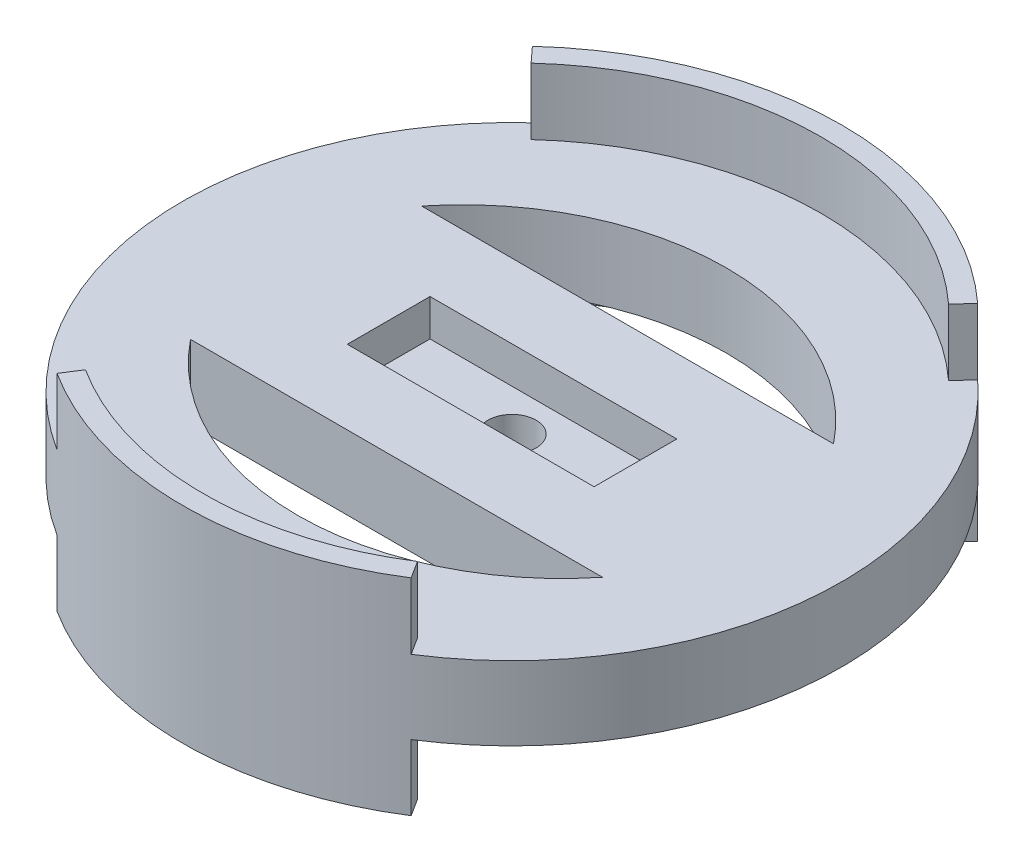
ISO-10303-21;
HEADER;
FILE_DESCRIPTION(('STEP AP214'),'2;1');
FILE_NAME('part.step','',(''),(''),'','','');
FILE_SCHEMA(('AUTOMOTIVE_DESIGN { 1 0 10303 214 1 1 1 1 }'));
ENDSEC;
DATA;
#1=APPLICATION_CONTEXT('core data for automotive mechanical design processes');
#2=APPLICATION_PROTOCOL_DEFINITION('international standard','automotive_design',2000,#1);
#3=PRODUCT_CONTEXT('',#1,'mechanical');
#4=PRODUCT('Part','Part','',(#3));
#5=PRODUCT_RELATED_PRODUCT_CATEGORY('part','',(#4));
#6=PRODUCT_DEFINITION_FORMATION('','',#4);
#7=PRODUCT_DEFINITION_CONTEXT('part definition',#1,'design');
#8=PRODUCT_DEFINITION('design','',#6,#7);
#9=PRODUCT_DEFINITION_SHAPE('','',#8);
#10=(LENGTH_UNIT() NAMED_UNIT(*) SI_UNIT(.MILLI.,.METRE.));
#11=(NAMED_UNIT(*) PLANE_ANGLE_UNIT() SI_UNIT($,.RADIAN.));
#12=(NAMED_UNIT(*) SI_UNIT($,.STERADIAN.) SOLID_ANGLE_UNIT());
#13=UNCERTAINTY_MEASURE_WITH_UNIT(LENGTH_MEASURE(1.E-05),#10,'distance_accuracy_value','');
#14=(GEOMETRIC_REPRESENTATION_CONTEXT(3) GLOBAL_UNCERTAINTY_ASSIGNED_CONTEXT((#13)) GLOBAL_UNIT_ASSIGNED_CONTEXT((#10,
#11,#12)) REPRESENTATION_CONTEXT('',''));
#15=CARTESIAN_POINT('',(0.,0.,0.));
#16=DIRECTION('',(0.,0.,1.));
#17=DIRECTION('',(1.,0.,0.));
#18=AXIS2_PLACEMENT_3D('',#15,#16,#17);
#19=CARTESIAN_POINT('',(0.,5.6642,0.));
#20=DIRECTION('',(0.,1.,0.));
#21=DIRECTION('',(0.,0.,1.));
#22=AXIS2_PLACEMENT_3D('',#19,#20,#21);
#23=PLANE('',#22);
#24=CARTESIAN_POINT('',(0.,5.6642,7.64751666666668));
#25=DIRECTION('',(0.,1.,0.));
#26=DIRECTION('',(0.,0.,-1.));
#27=AXIS2_PLACEMENT_3D('',#24,#25,#26);
#28=CIRCLE('',#27,40.6929166666667);
#29=CARTESIAN_POINT('',(31.75,5.6642,-17.8054));
#30=VERTEX_POINT('',#29);
#31=CARTESIAN_POINT('',(-31.75,5.6642,-17.8054));
#32=VERTEX_POINT('',#31);
#33=EDGE_CURVE('E57',#30,#32,#28,.T.);
#34=ORIENTED_EDGE('',*,*,#33,.F.);
#35=DIRECTION('',(1.,0.,0.));
#36=VECTOR('',#35,1.);
#37=CARTESIAN_POINT('',(-31.75,5.6642,-17.8054));
#38=LINE('',#37,#36);
#39=EDGE_CURVE('E213',#32,#30,#38,.T.);
#40=ORIENTED_EDGE('',*,*,#39,.F.);
#41=EDGE_LOOP('',(#34,#40));
#42=FACE_BOUND('',#41,.T.);
#43=CARTESIAN_POINT('',(0.,5.6642,-7.64751666666668));
#44=DIRECTION('',(0.,1.,0.));
#45=DIRECTION('',(0.,0.,1.));
#46=AXIS2_PLACEMENT_3D('',#43,#44,#45);
#47=CIRCLE('',#46,40.6929166666667);
#48=CARTESIAN_POINT('',(-31.75,5.6642,17.8054));
#49=VERTEX_POINT('',#48);
#50=CARTESIAN_POINT('',(31.75,5.6642,17.8054));
#51=VERTEX_POINT('',#50);
#52=EDGE_CURVE('E65',#49,#51,#47,.T.);
#53=ORIENTED_EDGE('',*,*,#52,.F.);
#54=DIRECTION('',(-1.,0.,0.));
#55=VECTOR('',#54,1.);
#56=CARTESIAN_POINT('',(-31.75,5.6642,17.8054));
#57=LINE('',#56,#55);
#58=EDGE_CURVE('E230',#51,#49,#57,.T.);
#59=ORIENTED_EDGE('',*,*,#58,.F.);
#60=EDGE_LOOP('',(#53,#59));
#61=FACE_BOUND('',#60,.T.);
#62=DIRECTION('',(-1.,0.,0.));
#63=VECTOR('',#62,1.);
#64=CARTESIAN_POINT('',(0.,5.6642,6.3754));
#65=LINE('',#64,#63);
#66=CARTESIAN_POINT('',(19.01825,5.6642,6.3754));
#67=VERTEX_POINT('',#66);
#68=CARTESIAN_POINT('',(-19.01825,5.6642,6.3754));
#69=VERTEX_POINT('',#68);
#70=EDGE_CURVE('E376',#67,#69,#65,.T.);
#71=ORIENTED_EDGE('',*,*,#70,.T.);
#72=DIRECTION('',(0.,0.,-1.));
#73=VECTOR('',#72,1.);
#74=CARTESIAN_POINT('',(-19.01825,5.6642,0.));
#75=LINE('',#74,#73);
#76=CARTESIAN_POINT('',(-19.01825,5.6642,-6.3754));
#77=VERTEX_POINT('',#76);
#78=EDGE_CURVE('E380',#69,#77,#75,.T.);
#79=ORIENTED_EDGE('',*,*,#78,.T.);
#80=DIRECTION('',(-1.,0.,0.));
#81=VECTOR('',#80,1.);
#82=CARTESIAN_POINT('',(0.,5.6642,-6.3754));
#83=LINE('',#82,#81);
#84=CARTESIAN_POINT('',(19.01825,5.6642,-6.3754));
#85=VERTEX_POINT('',#84);
#86=EDGE_CURVE('E384',#85,#77,#83,.T.);
#87=ORIENTED_EDGE('',*,*,#86,.F.);
#88=DIRECTION('',(0.,0.,-1.));
#89=VECTOR('',#88,1.);
#90=CARTESIAN_POINT('',(19.01825,5.6642,0.));
#91=LINE('',#90,#89);
#92=EDGE_CURVE('E388',#67,#85,#91,.T.);
#93=ORIENTED_EDGE('',*,*,#92,.F.);
#94=EDGE_LOOP('',(#71,#79,#87,#93));
#95=FACE_BOUND('',#94,.T.);
#96=CARTESIAN_POINT('',(0.,5.6642,0.));
#97=DIRECTION('',(0.,1.,0.));
#98=DIRECTION('',(0.,0.,1.));
#99=AXIS2_PLACEMENT_3D('',#96,#97,#98);
#100=CIRCLE('',#99,47.625);
#101=CARTESIAN_POINT('',(-25.5888938475175,5.6642,40.1665176068387));
#102=VERTEX_POINT('',#101);
#103=CARTESIAN_POINT('',(25.5888938475175,5.6642,40.1665176068387));
#104=VERTEX_POINT('',#103);
#105=EDGE_CURVE('E298',#102,#104,#100,.T.);
#106=ORIENTED_EDGE('',*,*,#105,.T.);
#107=DIRECTION('',(0.537299608346824,0.,0.843391445812885));
#108=VECTOR('',#107,1.);
#109=CARTESIAN_POINT('',(0.,5.6642,0.));
#110=LINE('',#109,#108);
#111=CARTESIAN_POINT('',(27.2948201040187,5.6642,42.8442854472946));
#112=VERTEX_POINT('',#111);
#113=EDGE_CURVE('E294',#104,#112,#110,.T.);
#114=ORIENTED_EDGE('',*,*,#113,.T.);
#115=CARTESIAN_POINT('',(0.,5.6642,0.));
#116=DIRECTION('',(0.,1.,0.));
#117=DIRECTION('',(0.,0.,1.));
#118=AXIS2_PLACEMENT_3D('',#115,#116,#117);
#119=CIRCLE('',#118,50.8);
#120=CARTESIAN_POINT('',(34.3199825468756,5.6642,-37.4536887099543));
#121=VERTEX_POINT('',#120);
#122=EDGE_CURVE('E392',#112,#121,#119,.T.);
#123=ORIENTED_EDGE('',*,*,#122,.T.);
#124=DIRECTION('',(-0.675590207615662,0.,0.737277336810123));
#125=VECTOR('',#124,1.);
#126=CARTESIAN_POINT('',(0.,5.6642,0.));
#127=LINE('',#126,#125);
#128=CARTESIAN_POINT('',(32.1749836376959,5.6642,-35.1128331655821));
#129=VERTEX_POINT('',#128);
#130=EDGE_CURVE('E354',#121,#129,#127,.T.);
#131=ORIENTED_EDGE('',*,*,#130,.T.);
#132=CARTESIAN_POINT('',(0.,5.6642,0.));
#133=DIRECTION('',(0.,1.,0.));
#134=DIRECTION('',(0.,0.,1.));
#135=AXIS2_PLACEMENT_3D('',#132,#133,#134);
#136=CIRCLE('',#135,47.625);
#137=CARTESIAN_POINT('',(-32.1749836376959,5.6642,-35.1128331655821));
#138=VERTEX_POINT('',#137);
#139=EDGE_CURVE('E358',#129,#138,#136,.T.);
#140=ORIENTED_EDGE('',*,*,#139,.T.);
#141=DIRECTION('',(-0.675590207615662,0.,-0.737277336810123));
#142=VECTOR('',#141,1.);
#143=CARTESIAN_POINT('',(0.,5.6642,0.));
#144=LINE('',#143,#142);
#145=CARTESIAN_POINT('',(-34.3199825468756,5.6642,-37.4536887099542));
#146=VERTEX_POINT('',#145);
#147=EDGE_CURVE('E350',#138,#146,#144,.T.);
#148=ORIENTED_EDGE('',*,*,#147,.T.);
#149=CARTESIAN_POINT('',(-27.2948201040187,5.6642,42.8442854472946));
#150=VERTEX_POINT('',#149);
#151=EDGE_CURVE('E393',#146,#150,#119,.T.);
#152=ORIENTED_EDGE('',*,*,#151,.T.);
#153=DIRECTION('',(0.537299608346824,0.,-0.843391445812885));
#154=VECTOR('',#153,1.);
#155=CARTESIAN_POINT('',(0.,5.6642,0.));
#156=LINE('',#155,#154);
#157=EDGE_CURVE('E286',#150,#102,#156,.T.);
#158=ORIENTED_EDGE('',*,*,#157,.T.);
#159=EDGE_LOOP('',(#106,#114,#123,#131,#140,#148,#152,#158));
#160=FACE_BOUND('',#159,.T.);
#161=ADVANCED_FACE('F41',(#42,#61,#95,#160),#23,.T.);
#162=CARTESIAN_POINT('',(0.,-5.715,0.));
#163=DIRECTION('',(0.,1.,0.));
#164=DIRECTION('',(0.,0.,1.));
#165=AXIS2_PLACEMENT_3D('',#162,#163,#164);
#166=PLANE('',#165);
#167=DIRECTION('',(1.,0.,0.));
#168=VECTOR('',#167,1.);
#169=CARTESIAN_POINT('',(0.,-5.715,-17.8054));
#170=LINE('',#169,#168);
#171=CARTESIAN_POINT('',(-31.75,-5.715,-17.8054));
#172=VERTEX_POINT('',#171);
#173=CARTESIAN_POINT('',(31.75,-5.715,-17.8054));
#174=VERTEX_POINT('',#173);
#175=EDGE_CURVE('E50',#172,#174,#170,.T.);
#176=ORIENTED_EDGE('',*,*,#175,.T.);
#177=CARTESIAN_POINT('',(0.,-5.715,7.64751666666668));
#178=DIRECTION('',(0.,1.,0.));
#179=DIRECTION('',(0.,0.,1.));
#180=AXIS2_PLACEMENT_3D('',#177,#178,#179);
#181=CIRCLE('',#180,40.6929166666667);
#182=EDGE_CURVE('E11',#174,#172,#181,.T.);
#183=ORIENTED_EDGE('',*,*,#182,.T.);
#184=EDGE_LOOP('',(#176,#183));
#185=FACE_BOUND('',#184,.T.);
#186=DIRECTION('',(-1.,0.,0.));
#187=VECTOR('',#186,1.);
#188=CARTESIAN_POINT('',(0.,-5.715,17.8054));
#189=LINE('',#188,#187);
#190=CARTESIAN_POINT('',(31.75,-5.715,17.8054));
#191=VERTEX_POINT('',#190);
#192=CARTESIAN_POINT('',(-31.75,-5.715,17.8054));
#193=VERTEX_POINT('',#192);
#194=EDGE_CURVE('E441',#191,#193,#189,.T.);
#195=ORIENTED_EDGE('',*,*,#194,.T.);
#196=CARTESIAN_POINT('',(0.,-5.715,-7.64751666666668));
#197=DIRECTION('',(0.,1.,0.));
#198=DIRECTION('',(0.,0.,1.));
#199=AXIS2_PLACEMENT_3D('',#196,#197,#198);
#200=CIRCLE('',#199,40.6929166666667);
#201=EDGE_CURVE('E445',#193,#191,#200,.T.);
#202=ORIENTED_EDGE('',*,*,#201,.T.);
#203=EDGE_LOOP('',(#195,#202));
#204=FACE_BOUND('',#203,.T.);
#205=CARTESIAN_POINT('',(0.,-5.715,0.));
#206=DIRECTION('',(0.,1.,0.));
#207=DIRECTION('',(0.,0.,1.));
#208=AXIS2_PLACEMENT_3D('',#205,#206,#207);
#209=CIRCLE('',#208,3.71475);
#210=CARTESIAN_POINT('',(0.,-5.715,3.71475));
#211=VERTEX_POINT('',#210);
#212=EDGE_CURVE('E367',#211,#211,#209,.T.);
#213=ORIENTED_EDGE('',*,*,#212,.T.);
#214=EDGE_LOOP('',(#213));
#215=FACE_BOUND('',#214,.T.);
#216=DIRECTION('',(0.537299608346824,0.,0.843391445812885));
#217=VECTOR('',#216,1.);
#218=CARTESIAN_POINT('',(0.,-5.715,0.));
#219=LINE('',#218,#217);
#220=CARTESIAN_POINT('',(25.5888938475175,-5.715,40.1665176068387));
#221=VERTEX_POINT('',#220);
#222=CARTESIAN_POINT('',(27.2948201040187,-5.715,42.8442854472946));
#223=VERTEX_POINT('',#222);
#224=EDGE_CURVE('E290',#221,#223,#219,.T.);
#225=ORIENTED_EDGE('',*,*,#224,.F.);
#226=CARTESIAN_POINT('',(0.,-5.715,0.));
#227=DIRECTION('',(0.,1.,0.));
#228=DIRECTION('',(0.,0.,1.));
#229=AXIS2_PLACEMENT_3D('',#226,#227,#228);
#230=CIRCLE('',#229,47.625);
#231=CARTESIAN_POINT('',(-25.5888938475175,-5.715,40.1665176068387));
#232=VERTEX_POINT('',#231);
#233=EDGE_CURVE('E437',#232,#221,#230,.T.);
#234=ORIENTED_EDGE('',*,*,#233,.F.);
#235=DIRECTION('',(0.537299608346824,0.,-0.843391445812885));
#236=VECTOR('',#235,1.);
#237=CARTESIAN_POINT('',(0.,-5.715,0.));
#238=LINE('',#237,#236);
#239=CARTESIAN_POINT('',(-27.2948201040187,-5.715,42.8442854472946));
#240=VERTEX_POINT('',#239);
#241=EDGE_CURVE('E282',#240,#232,#238,.T.);
#242=ORIENTED_EDGE('',*,*,#241,.F.);
#243=CARTESIAN_POINT('',(0.,-5.715,0.));
#244=DIRECTION('',(0.,1.,0.));
#245=DIRECTION('',(0.,0.,1.));
#246=AXIS2_PLACEMENT_3D('',#243,#244,#245);
#247=CIRCLE('',#246,50.8);
#248=CARTESIAN_POINT('',(-34.3199825468756,-5.715,-37.4536887099543));
#249=VERTEX_POINT('',#248);
#250=EDGE_CURVE('E363',#249,#240,#247,.T.);
#251=ORIENTED_EDGE('',*,*,#250,.F.);
#252=DIRECTION('',(-0.675590207615662,0.,-0.737277336810123));
#253=VECTOR('',#252,1.);
#254=CARTESIAN_POINT('',(0.,-5.715,0.));
#255=LINE('',#254,#253);
#256=CARTESIAN_POINT('',(-32.1749836376959,-5.715,-35.1128331655821));
#257=VERTEX_POINT('',#256);
#258=EDGE_CURVE('E425',#257,#249,#255,.T.);
#259=ORIENTED_EDGE('',*,*,#258,.F.);
#260=CARTESIAN_POINT('',(0.,-5.715,0.));
#261=DIRECTION('',(0.,1.,0.));
#262=DIRECTION('',(0.,0.,1.));
#263=AXIS2_PLACEMENT_3D('',#260,#261,#262);
#264=CIRCLE('',#263,47.625);
#265=CARTESIAN_POINT('',(32.1749836376959,-5.715,-35.1128331655821));
#266=VERTEX_POINT('',#265);
#267=EDGE_CURVE('E429',#266,#257,#264,.T.);
#268=ORIENTED_EDGE('',*,*,#267,.F.);
#269=DIRECTION('',(-0.675590207615662,0.,0.737277336810123));
#270=VECTOR('',#269,1.);
#271=CARTESIAN_POINT('',(0.,-5.715,0.));
#272=LINE('',#271,#270);
#273=CARTESIAN_POINT('',(34.3199825468756,-5.715,-37.4536887099543));
#274=VERTEX_POINT('',#273);
#275=EDGE_CURVE('E433',#274,#266,#272,.T.);
#276=ORIENTED_EDGE('',*,*,#275,.F.);
#277=EDGE_CURVE('E368',#223,#274,#247,.T.);
#278=ORIENTED_EDGE('',*,*,#277,.F.);
#279=EDGE_LOOP('',(#225,#234,#242,#251,#259,#268,#276,#278));
#280=FACE_BOUND('',#279,.T.);
#281=ADVANCED_FACE('F450',(#185,#204,#215,#280),#166,.F.);
#282=CARTESIAN_POINT('',(0.,5.6642,6.3754));
#283=DIRECTION('',(0.,0.,1.));
#284=DIRECTION('',(1.,0.,0.));
#285=AXIS2_PLACEMENT_3D('',#282,#283,#284);
#286=PLANE('',#285);
#287=DIRECTION('',(-1.,0.,0.));
#288=VECTOR('',#287,1.);
#289=CARTESIAN_POINT('',(0.,0.,6.3754));
#290=LINE('',#289,#288);
#291=CARTESIAN_POINT('',(19.01825,0.,6.3754));
#292=VERTEX_POINT('',#291);
#293=CARTESIAN_POINT('',(-19.01825,0.,6.3754));
#294=VERTEX_POINT('',#293);
#295=EDGE_CURVE('E372',#292,#294,#290,.T.);
#296=ORIENTED_EDGE('',*,*,#295,.T.);
#297=DIRECTION('',(0.,-1.,0.));
#298=VECTOR('',#297,1.);
#299=CARTESIAN_POINT('',(-19.01825,5.6642,6.3754));
#300=LINE('',#299,#298);
#301=EDGE_CURVE('E421',#69,#294,#300,.T.);
#302=ORIENTED_EDGE('',*,*,#301,.F.);
#303=ORIENTED_EDGE('',*,*,#70,.F.);
#304=DIRECTION('',(0.,-1.,0.));
#305=VECTOR('',#304,1.);
#306=CARTESIAN_POINT('',(19.01825,5.6642,6.3754));
#307=LINE('',#306,#305);
#308=EDGE_CURVE('E397',#67,#292,#307,.T.);
#309=ORIENTED_EDGE('',*,*,#308,.T.);
#310=EDGE_LOOP('',(#296,#302,#303,#309));
#311=FACE_BOUND('',#310,.T.);
#312=ADVANCED_FACE('F43',(#311),#286,.F.);
#313=CARTESIAN_POINT('',(-19.01825,5.6642,0.));
#314=DIRECTION('',(-1.,0.,0.));
#315=DIRECTION('',(0.,0.,1.));
#316=AXIS2_PLACEMENT_3D('',#313,#314,#315);
#317=PLANE('',#316);
#318=DIRECTION('',(0.,0.,-1.));
#319=VECTOR('',#318,1.);
#320=CARTESIAN_POINT('',(-19.01825,0.,0.));
#321=LINE('',#320,#319);
#322=CARTESIAN_POINT('',(-19.01825,0.,-6.3754));
#323=VERTEX_POINT('',#322);
#324=EDGE_CURVE('E401',#294,#323,#321,.T.);
#325=ORIENTED_EDGE('',*,*,#324,.T.);
#326=DIRECTION('',(0.,-1.,0.));
#327=VECTOR('',#326,1.);
#328=CARTESIAN_POINT('',(-19.01825,5.6642,-6.3754));
#329=LINE('',#328,#327);
#330=EDGE_CURVE('E417',#77,#323,#329,.T.);
#331=ORIENTED_EDGE('',*,*,#330,.F.);
#332=ORIENTED_EDGE('',*,*,#78,.F.);
#333=ORIENTED_EDGE('',*,*,#301,.T.);
#334=EDGE_LOOP('',(#325,#331,#332,#333));
#335=FACE_BOUND('',#334,.T.);
#336=ADVANCED_FACE('F512',(#335),#317,.F.);
#337=CARTESIAN_POINT('',(0.,5.6642,-6.3754));
#338=DIRECTION('',(0.,0.,1.));
#339=DIRECTION('',(1.,0.,0.));
#340=AXIS2_PLACEMENT_3D('',#337,#338,#339);
#341=PLANE('',#340);
#342=DIRECTION('',(-1.,0.,0.));
#343=VECTOR('',#342,1.);
#344=CARTESIAN_POINT('',(0.,0.,-6.3754));
#345=LINE('',#344,#343);
#346=CARTESIAN_POINT('',(19.01825,0.,-6.3754));
#347=VERTEX_POINT('',#346);
#348=EDGE_CURVE('E405',#347,#323,#345,.T.);
#349=ORIENTED_EDGE('',*,*,#348,.F.);
#350=DIRECTION('',(0.,-1.,0.));
#351=VECTOR('',#350,1.);
#352=CARTESIAN_POINT('',(19.01825,5.6642,-6.3754));
#353=LINE('',#352,#351);
#354=EDGE_CURVE('E413',#85,#347,#353,.T.);
#355=ORIENTED_EDGE('',*,*,#354,.F.);
#356=ORIENTED_EDGE('',*,*,#86,.T.);
#357=ORIENTED_EDGE('',*,*,#330,.T.);
#358=EDGE_LOOP('',(#349,#355,#356,#357));
#359=FACE_BOUND('',#358,.T.);
#360=ADVANCED_FACE('F509',(#359),#341,.T.);
#361=CARTESIAN_POINT('',(19.01825,5.6642,0.));
#362=DIRECTION('',(-1.,0.,0.));
#363=DIRECTION('',(0.,0.,1.));
#364=AXIS2_PLACEMENT_3D('',#361,#362,#363);
#365=PLANE('',#364);
#366=DIRECTION('',(0.,0.,-1.));
#367=VECTOR('',#366,1.);
#368=CARTESIAN_POINT('',(19.01825,0.,0.));
#369=LINE('',#368,#367);
#370=EDGE_CURVE('E381',#292,#347,#369,.T.);
#371=ORIENTED_EDGE('',*,*,#370,.F.);
#372=ORIENTED_EDGE('',*,*,#308,.F.);
#373=ORIENTED_EDGE('',*,*,#92,.T.);
#374=ORIENTED_EDGE('',*,*,#354,.T.);
#375=EDGE_LOOP('',(#371,#372,#373,#374));
#376=FACE_BOUND('',#375,.T.);
#377=ADVANCED_FACE('F505',(#376),#365,.T.);
#378=CARTESIAN_POINT('',(0.,5.6642,0.));
#379=DIRECTION('',(0.,-1.,0.));
#380=DIRECTION('',(0.,0.,-1.));
#381=AXIS2_PLACEMENT_3D('',#378,#379,#380);
#382=CYLINDRICAL_SURFACE('',#381,50.8);
#383=ORIENTED_EDGE('',*,*,#122,.F.);
#384=DIRECTION('',(0.,-1.,0.));
#385=VECTOR('',#384,1.);
#386=CARTESIAN_POINT('',(27.2948201040187,15.875,42.8442854472946));
#387=LINE('',#386,#385);
#388=CARTESIAN_POINT('',(27.2948201040187,15.875,42.8442854472946));
#389=VERTEX_POINT('',#388);
#390=EDGE_CURVE('E279',#389,#112,#387,.T.);
#391=ORIENTED_EDGE('',*,*,#390,.F.);
#392=CARTESIAN_POINT('',(0.,15.875,0.));
#393=DIRECTION('',(0.,1.,0.));
#394=DIRECTION('',(0.,0.,1.));
#395=AXIS2_PLACEMENT_3D('',#392,#393,#394);
#396=CIRCLE('',#395,50.8);
#397=CARTESIAN_POINT('',(-27.2948201040187,15.875,42.8442854472946));
#398=VERTEX_POINT('',#397);
#399=EDGE_CURVE('E236',#398,#389,#396,.T.);
#400=ORIENTED_EDGE('',*,*,#399,.F.);
#401=DIRECTION('',(0.,-1.,0.));
#402=VECTOR('',#401,1.);
#403=CARTESIAN_POINT('',(-27.2948201040187,15.875,42.8442854472946));
#404=LINE('',#403,#402);
#405=EDGE_CURVE('E265',#398,#150,#404,.T.);
#406=ORIENTED_EDGE('',*,*,#405,.T.);
#407=ORIENTED_EDGE('',*,*,#151,.F.);
#408=DIRECTION('',(0.,-1.,0.));
#409=VECTOR('',#408,1.);
#410=CARTESIAN_POINT('',(-34.3199825468756,15.875,-37.4536887099543));
#411=LINE('',#410,#409);
#412=CARTESIAN_POINT('',(-34.3199825468756,15.875,-37.4536887099543));
#413=VERTEX_POINT('',#412);
#414=EDGE_CURVE('E337',#413,#146,#411,.T.);
#415=ORIENTED_EDGE('',*,*,#414,.F.);
#416=CARTESIAN_POINT('',(0.,15.875,0.));
#417=DIRECTION('',(0.,1.,0.));
#418=DIRECTION('',(0.,0.,1.));
#419=AXIS2_PLACEMENT_3D('',#416,#417,#418);
#420=CIRCLE('',#419,50.8);
#421=CARTESIAN_POINT('',(34.3199825468756,15.875,-37.4536887099543));
#422=VERTEX_POINT('',#421);
#423=EDGE_CURVE('E311',#422,#413,#420,.T.);
#424=ORIENTED_EDGE('',*,*,#423,.F.);
#425=DIRECTION('',(0.,-1.,0.));
#426=VECTOR('',#425,1.);
#427=CARTESIAN_POINT('',(34.3199825468756,15.875,-37.4536887099543));
#428=LINE('',#427,#426);
#429=EDGE_CURVE('E341',#422,#121,#428,.T.);
#430=ORIENTED_EDGE('',*,*,#429,.T.);
#431=EDGE_LOOP('',(#383,#391,#400,#406,#407,#415,#424,#430));
#432=FACE_BOUND('',#431,.T.);
#433=ORIENTED_EDGE('',*,*,#250,.T.);
#434=CARTESIAN_POINT('',(-27.2948201040187,-15.875,42.8442854472946));
#435=VERTEX_POINT('',#434);
#436=EDGE_CURVE('E250',#240,#435,#404,.T.);
#437=ORIENTED_EDGE('',*,*,#436,.T.);
#438=CARTESIAN_POINT('',(0.,-15.875,0.));
#439=DIRECTION('',(0.,1.,0.));
#440=DIRECTION('',(0.,0.,1.));
#441=AXIS2_PLACEMENT_3D('',#438,#439,#440);
#442=CIRCLE('',#441,50.8);
#443=CARTESIAN_POINT('',(27.2948201040187,-15.875,42.8442854472946));
#444=VERTEX_POINT('',#443);
#445=EDGE_CURVE('E209',#435,#444,#442,.T.);
#446=ORIENTED_EDGE('',*,*,#445,.T.);
#447=EDGE_CURVE('E278',#223,#444,#387,.T.);
#448=ORIENTED_EDGE('',*,*,#447,.F.);
#449=ORIENTED_EDGE('',*,*,#277,.T.);
#450=CARTESIAN_POINT('',(34.3199825468756,-15.875,-37.4536887099543));
#451=VERTEX_POINT('',#450);
#452=EDGE_CURVE('E340',#274,#451,#428,.T.);
#453=ORIENTED_EDGE('',*,*,#452,.T.);
#454=CARTESIAN_POINT('',(0.,-15.875,0.));
#455=DIRECTION('',(0.,1.,0.));
#456=DIRECTION('',(0.,0.,1.));
#457=AXIS2_PLACEMENT_3D('',#454,#455,#456);
#458=CIRCLE('',#457,50.8);
#459=CARTESIAN_POINT('',(-34.3199825468756,-15.875,-37.4536887099543));
#460=VERTEX_POINT('',#459);
#461=EDGE_CURVE('E325',#451,#460,#458,.T.);
#462=ORIENTED_EDGE('',*,*,#461,.T.);
#463=EDGE_CURVE('E336',#249,#460,#411,.T.);
#464=ORIENTED_EDGE('',*,*,#463,.F.);
#465=EDGE_LOOP('',(#433,#437,#446,#448,#449,#453,#462,#464));
#466=FACE_BOUND('',#465,.T.);
#467=ADVANCED_FACE('F473',(#432,#466),#382,.T.);
#468=CARTESIAN_POINT('',(0.,0.,0.));
#469=DIRECTION('',(0.,1.,0.));
#470=DIRECTION('',(0.,0.,1.));
#471=AXIS2_PLACEMENT_3D('',#468,#469,#470);
#472=PLANE('',#471);
#473=CARTESIAN_POINT('',(0.,0.,0.));
#474=DIRECTION('',(0.,1.,0.));
#475=DIRECTION('',(0.,0.,1.));
#476=AXIS2_PLACEMENT_3D('',#473,#474,#475);
#477=CIRCLE('',#476,3.71475);
#478=CARTESIAN_POINT('',(0.,0.,3.71475));
#479=VERTEX_POINT('',#478);
#480=EDGE_CURVE('E362',#479,#479,#477,.T.);
#481=ORIENTED_EDGE('',*,*,#480,.F.);
#482=EDGE_LOOP('',(#481));
#483=FACE_BOUND('',#482,.T.);
#484=ORIENTED_EDGE('',*,*,#295,.F.);
#485=ORIENTED_EDGE('',*,*,#370,.T.);
#486=ORIENTED_EDGE('',*,*,#348,.T.);
#487=ORIENTED_EDGE('',*,*,#324,.F.);
#488=EDGE_LOOP('',(#484,#485,#486,#487));
#489=FACE_BOUND('',#488,.T.);
#490=ADVANCED_FACE('F504',(#483,#489),#472,.T.);
#491=CARTESIAN_POINT('',(0.,-5.715,0.));
#492=DIRECTION('',(0.,1.,0.));
#493=DIRECTION('',(0.,0.,1.));
#494=AXIS2_PLACEMENT_3D('',#491,#492,#493);
#495=CYLINDRICAL_SURFACE('',#494,3.71475);
#496=ORIENTED_EDGE('',*,*,#212,.F.);
#497=EDGE_LOOP('',(#496));
#498=FACE_BOUND('',#497,.T.);
#499=ORIENTED_EDGE('',*,*,#480,.T.);
#500=EDGE_LOOP('',(#499));
#501=FACE_BOUND('',#500,.T.);
#502=ADVANCED_FACE('F500',(#498,#501),#495,.F.);
#503=CARTESIAN_POINT('',(0.,-15.875,0.));
#504=DIRECTION('',(0.,1.,0.));
#505=DIRECTION('',(0.,0.,1.));
#506=AXIS2_PLACEMENT_3D('',#503,#504,#505);
#507=PLANE('',#506);
#508=CARTESIAN_POINT('',(0.,-15.875,0.));
#509=DIRECTION('',(0.,-1.,0.));
#510=DIRECTION('',(0.,0.,1.));
#511=AXIS2_PLACEMENT_3D('',#508,#509,#510);
#512=CIRCLE('',#511,47.625);
#513=CARTESIAN_POINT('',(-32.1749836376959,-15.875,-35.1128331655821));
#514=VERTEX_POINT('',#513);
#515=CARTESIAN_POINT('',(32.1749836376959,-15.875,-35.1128331655821));
#516=VERTEX_POINT('',#515);
#517=EDGE_CURVE('E302',#514,#516,#512,.T.);
#518=ORIENTED_EDGE('',*,*,#517,.F.);
#519=DIRECTION('',(0.675590207615662,0.,0.737277336810123));
#520=VECTOR('',#519,1.);
#521=CARTESIAN_POINT('',(-32.1749836376959,-15.875,-35.1128331655821));
#522=LINE('',#521,#520);
#523=EDGE_CURVE('E308',#460,#514,#522,.T.);
#524=ORIENTED_EDGE('',*,*,#523,.F.);
#525=ORIENTED_EDGE('',*,*,#461,.F.);
#526=DIRECTION('',(0.675590207615662,0.,-0.737277336810123));
#527=VECTOR('',#526,1.);
#528=CARTESIAN_POINT('',(32.1749836376959,-15.875,-35.1128331655821));
#529=LINE('',#528,#527);
#530=EDGE_CURVE('E321',#516,#451,#529,.T.);
#531=ORIENTED_EDGE('',*,*,#530,.F.);
#532=EDGE_LOOP('',(#518,#524,#525,#531));
#533=FACE_BOUND('',#532,.T.);
#534=ADVANCED_FACE('F560',(#533),#507,.F.);
#535=CARTESIAN_POINT('',(-32.1749836376959,15.875,-35.1128331655821));
#536=DIRECTION('',(0.737277336810123,0.,-0.675590207615662));
#537=DIRECTION('',(-0.675590207615662,0.,-0.737277336810123));
#538=AXIS2_PLACEMENT_3D('',#535,#536,#537);
#539=PLANE('',#538);
#540=DIRECTION('',(0.,-1.,0.));
#541=VECTOR('',#540,1.);
#542=CARTESIAN_POINT('',(-32.1749836376959,15.875,-35.1128331655821));
#543=LINE('',#542,#541);
#544=EDGE_CURVE('E317',#257,#514,#543,.T.);
#545=ORIENTED_EDGE('',*,*,#544,.F.);
#546=ORIENTED_EDGE('',*,*,#258,.T.);
#547=ORIENTED_EDGE('',*,*,#463,.T.);
#548=ORIENTED_EDGE('',*,*,#523,.T.);
#549=EDGE_LOOP('',(#545,#546,#547,#548));
#550=FACE_BOUND('',#549,.T.);
#551=ADVANCED_FACE('F563',(#550),#539,.F.);
#552=CARTESIAN_POINT('',(32.1749836376959,15.875,-35.1128331655821));
#553=DIRECTION('',(-0.737277336810123,0.,-0.675590207615662));
#554=DIRECTION('',(-0.675590207615662,0.,0.737277336810123));
#555=AXIS2_PLACEMENT_3D('',#552,#553,#554);
#556=PLANE('',#555);
#557=ORIENTED_EDGE('',*,*,#452,.F.);
#558=ORIENTED_EDGE('',*,*,#275,.T.);
#559=DIRECTION('',(0.,-1.,0.));
#560=VECTOR('',#559,1.);
#561=CARTESIAN_POINT('',(32.1749836376959,15.875,-35.1128331655821));
#562=LINE('',#561,#560);
#563=EDGE_CURVE('E345',#266,#516,#562,.T.);
#564=ORIENTED_EDGE('',*,*,#563,.T.);
#565=ORIENTED_EDGE('',*,*,#530,.T.);
#566=EDGE_LOOP('',(#557,#558,#564,#565));
#567=FACE_BOUND('',#566,.T.);
#568=ADVANCED_FACE('F554',(#567),#556,.F.);
#569=CARTESIAN_POINT('',(0.,15.875,0.));
#570=DIRECTION('',(0.,-1.,0.));
#571=DIRECTION('',(0.,0.,-1.));
#572=AXIS2_PLACEMENT_3D('',#569,#570,#571);
#573=CYLINDRICAL_SURFACE('',#572,47.625);
#574=ORIENTED_EDGE('',*,*,#563,.F.);
#575=ORIENTED_EDGE('',*,*,#267,.T.);
#576=ORIENTED_EDGE('',*,*,#544,.T.);
#577=ORIENTED_EDGE('',*,*,#517,.T.);
#578=EDGE_LOOP('',(#574,#575,#576,#577));
#579=FACE_BOUND('',#578,.T.);
#580=ADVANCED_FACE('F565',(#579),#573,.F.);
#581=ORIENTED_EDGE('',*,*,#139,.F.);
#582=CARTESIAN_POINT('',(32.1749836376959,15.875,-35.1128331655821));
#583=VERTEX_POINT('',#582);
#584=EDGE_CURVE('E346',#583,#129,#562,.T.);
#585=ORIENTED_EDGE('',*,*,#584,.F.);
#586=CARTESIAN_POINT('',(0.,15.875,0.));
#587=DIRECTION('',(0.,-1.,0.));
#588=DIRECTION('',(0.,0.,1.));
#589=AXIS2_PLACEMENT_3D('',#586,#587,#588);
#590=CIRCLE('',#589,47.625);
#591=CARTESIAN_POINT('',(-32.1749836376959,15.875,-35.1128331655821));
#592=VERTEX_POINT('',#591);
#593=EDGE_CURVE('E303',#592,#583,#590,.T.);
#594=ORIENTED_EDGE('',*,*,#593,.F.);
#595=EDGE_CURVE('E332',#592,#138,#543,.T.);
#596=ORIENTED_EDGE('',*,*,#595,.T.);
#597=EDGE_LOOP('',(#581,#585,#594,#596));
#598=FACE_BOUND('',#597,.T.);
#599=ADVANCED_FACE('F567',(#598),#573,.F.);
#600=ORIENTED_EDGE('',*,*,#130,.F.);
#601=ORIENTED_EDGE('',*,*,#429,.F.);
#602=DIRECTION('',(0.675590207615662,0.,-0.737277336810123));
#603=VECTOR('',#602,1.);
#604=CARTESIAN_POINT('',(32.1749836376959,15.875,-35.1128331655821));
#605=LINE('',#604,#603);
#606=EDGE_CURVE('E307',#583,#422,#605,.T.);
#607=ORIENTED_EDGE('',*,*,#606,.F.);
#608=ORIENTED_EDGE('',*,*,#584,.T.);
#609=EDGE_LOOP('',(#600,#601,#607,#608));
#610=FACE_BOUND('',#609,.T.);
#611=ADVANCED_FACE('F573',(#610),#556,.F.);
#612=ORIENTED_EDGE('',*,*,#147,.F.);
#613=ORIENTED_EDGE('',*,*,#595,.F.);
#614=DIRECTION('',(0.675590207615662,0.,0.737277336810123));
#615=VECTOR('',#614,1.);
#616=CARTESIAN_POINT('',(-32.1749836376959,15.875,-35.1128331655821));
#617=LINE('',#616,#615);
#618=EDGE_CURVE('E314',#413,#592,#617,.T.);
#619=ORIENTED_EDGE('',*,*,#618,.F.);
#620=ORIENTED_EDGE('',*,*,#414,.T.);
#621=EDGE_LOOP('',(#612,#613,#619,#620));
#622=FACE_BOUND('',#621,.T.);
#623=ADVANCED_FACE('F490',(#622),#539,.F.);
#624=CARTESIAN_POINT('',(0.,15.875,0.));
#625=DIRECTION('',(0.,1.,0.));
#626=DIRECTION('',(0.,0.,1.));
#627=AXIS2_PLACEMENT_3D('',#624,#625,#626);
#628=PLANE('',#627);
#629=ORIENTED_EDGE('',*,*,#593,.T.);
#630=ORIENTED_EDGE('',*,*,#606,.T.);
#631=ORIENTED_EDGE('',*,*,#423,.T.);
#632=ORIENTED_EDGE('',*,*,#618,.T.);
#633=EDGE_LOOP('',(#629,#630,#631,#632));
#634=FACE_BOUND('',#633,.T.);
#635=ADVANCED_FACE('F482',(#634),#628,.T.);
#636=CARTESIAN_POINT('',(0.,-15.875,0.));
#637=DIRECTION('',(0.,1.,0.));
#638=DIRECTION('',(0.,0.,1.));
#639=AXIS2_PLACEMENT_3D('',#636,#637,#638);
#640=PLANE('',#639);
#641=ORIENTED_EDGE('',*,*,#445,.F.);
#642=DIRECTION('',(-0.537299608346824,0.,0.843391445812885));
#643=VECTOR('',#642,1.);
#644=CARTESIAN_POINT('',(-25.5888938475175,-15.875,40.1665176068387));
#645=LINE('',#644,#643);
#646=CARTESIAN_POINT('',(-25.5888938475175,-15.875,40.1665176068387));
#647=VERTEX_POINT('',#646);
#648=EDGE_CURVE('E241',#647,#435,#645,.T.);
#649=ORIENTED_EDGE('',*,*,#648,.F.);
#650=CARTESIAN_POINT('',(0.,-15.875,0.));
#651=DIRECTION('',(0.,-1.,0.));
#652=DIRECTION('',(0.,0.,1.));
#653=AXIS2_PLACEMENT_3D('',#650,#651,#652);
#654=CIRCLE('',#653,47.625);
#655=CARTESIAN_POINT('',(25.5888938475175,-15.875,40.1665176068387));
#656=VERTEX_POINT('',#655);
#657=EDGE_CURVE('E258',#656,#647,#654,.T.);
#658=ORIENTED_EDGE('',*,*,#657,.F.);
#659=DIRECTION('',(-0.537299608346824,0.,-0.843391445812885));
#660=VECTOR('',#659,1.);
#661=CARTESIAN_POINT('',(25.5888938475175,-15.875,40.1665176068387));
#662=LINE('',#661,#660);
#663=EDGE_CURVE('E254',#444,#656,#662,.T.);
#664=ORIENTED_EDGE('',*,*,#663,.F.);
#665=EDGE_LOOP('',(#641,#649,#658,#664));
#666=FACE_BOUND('',#665,.T.);
#667=ADVANCED_FACE('F480',(#666),#640,.F.);
#668=CARTESIAN_POINT('',(-25.5888938475175,15.875,40.1665176068387));
#669=DIRECTION('',(0.843391445812885,0.,0.537299608346824));
#670=DIRECTION('',(0.537299608346824,0.,-0.843391445812885));
#671=AXIS2_PLACEMENT_3D('',#668,#669,#670);
#672=PLANE('',#671);
#673=ORIENTED_EDGE('',*,*,#436,.F.);
#674=ORIENTED_EDGE('',*,*,#241,.T.);
#675=DIRECTION('',(0.,-1.,0.));
#676=VECTOR('',#675,1.);
#677=CARTESIAN_POINT('',(-25.5888938475175,15.875,40.1665176068387));
#678=LINE('',#677,#676);
#679=EDGE_CURVE('E269',#232,#647,#678,.T.);
#680=ORIENTED_EDGE('',*,*,#679,.T.);
#681=ORIENTED_EDGE('',*,*,#648,.T.);
#682=EDGE_LOOP('',(#673,#674,#680,#681));
#683=FACE_BOUND('',#682,.T.);
#684=ADVANCED_FACE('F478',(#683),#672,.F.);
#685=CARTESIAN_POINT('',(0.,15.875,0.));
#686=DIRECTION('',(0.,-1.,0.));
#687=DIRECTION('',(0.,0.,-1.));
#688=AXIS2_PLACEMENT_3D('',#685,#686,#687);
#689=CYLINDRICAL_SURFACE('',#688,47.625);
#690=ORIENTED_EDGE('',*,*,#679,.F.);
#691=ORIENTED_EDGE('',*,*,#233,.T.);
#692=DIRECTION('',(0.,-1.,0.));
#693=VECTOR('',#692,1.);
#694=CARTESIAN_POINT('',(25.5888938475175,15.875,40.1665176068387));
#695=LINE('',#694,#693);
#696=EDGE_CURVE('E273',#221,#656,#695,.T.);
#697=ORIENTED_EDGE('',*,*,#696,.T.);
#698=ORIENTED_EDGE('',*,*,#657,.T.);
#699=EDGE_LOOP('',(#690,#691,#697,#698));
#700=FACE_BOUND('',#699,.T.);
#701=ADVANCED_FACE('F463',(#700),#689,.F.);
#702=CARTESIAN_POINT('',(25.5888938475175,15.875,40.1665176068387));
#703=DIRECTION('',(-0.843391445812885,0.,0.537299608346824));
#704=DIRECTION('',(0.537299608346824,0.,0.843391445812885));
#705=AXIS2_PLACEMENT_3D('',#702,#703,#704);
#706=PLANE('',#705);
#707=ORIENTED_EDGE('',*,*,#696,.F.);
#708=ORIENTED_EDGE('',*,*,#224,.T.);
#709=ORIENTED_EDGE('',*,*,#447,.T.);
#710=ORIENTED_EDGE('',*,*,#663,.T.);
#711=EDGE_LOOP('',(#707,#708,#709,#710));
#712=FACE_BOUND('',#711,.T.);
#713=ADVANCED_FACE('F464',(#712),#706,.F.);
#714=ORIENTED_EDGE('',*,*,#113,.F.);
#715=CARTESIAN_POINT('',(25.5888938475175,15.875,40.1665176068387));
#716=VERTEX_POINT('',#715);
#717=EDGE_CURVE('E274',#716,#104,#695,.T.);
#718=ORIENTED_EDGE('',*,*,#717,.F.);
#719=DIRECTION('',(-0.537299608346824,0.,-0.843391445812885));
#720=VECTOR('',#719,1.);
#721=CARTESIAN_POINT('',(25.5888938475175,15.875,40.1665176068387));
#722=LINE('',#721,#720);
#723=EDGE_CURVE('E240',#389,#716,#722,.T.);
#724=ORIENTED_EDGE('',*,*,#723,.F.);
#725=ORIENTED_EDGE('',*,*,#390,.T.);
#726=EDGE_LOOP('',(#714,#718,#724,#725));
#727=FACE_BOUND('',#726,.T.);
#728=ADVANCED_FACE('F539',(#727),#706,.F.);
#729=ORIENTED_EDGE('',*,*,#105,.F.);
#730=CARTESIAN_POINT('',(-25.5888938475175,15.875,40.1665176068387));
#731=VERTEX_POINT('',#730);
#732=EDGE_CURVE('E270',#731,#102,#678,.T.);
#733=ORIENTED_EDGE('',*,*,#732,.F.);
#734=CARTESIAN_POINT('',(0.,15.875,0.));
#735=DIRECTION('',(0.,-1.,0.));
#736=DIRECTION('',(0.,0.,1.));
#737=AXIS2_PLACEMENT_3D('',#734,#735,#736);
#738=CIRCLE('',#737,47.625);
#739=EDGE_CURVE('E244',#716,#731,#738,.T.);
#740=ORIENTED_EDGE('',*,*,#739,.F.);
#741=ORIENTED_EDGE('',*,*,#717,.T.);
#742=EDGE_LOOP('',(#729,#733,#740,#741));
#743=FACE_BOUND('',#742,.T.);
#744=ADVANCED_FACE('F534',(#743),#689,.F.);
#745=ORIENTED_EDGE('',*,*,#157,.F.);
#746=ORIENTED_EDGE('',*,*,#405,.F.);
#747=DIRECTION('',(-0.537299608346824,0.,0.843391445812885));
#748=VECTOR('',#747,1.);
#749=CARTESIAN_POINT('',(-25.5888938475175,15.875,40.1665176068387));
#750=LINE('',#749,#748);
#751=EDGE_CURVE('E247',#731,#398,#750,.T.);
#752=ORIENTED_EDGE('',*,*,#751,.F.);
#753=ORIENTED_EDGE('',*,*,#732,.T.);
#754=EDGE_LOOP('',(#745,#746,#752,#753));
#755=FACE_BOUND('',#754,.T.);
#756=ADVANCED_FACE('F489',(#755),#672,.F.);
#757=CARTESIAN_POINT('',(0.,15.875,0.));
#758=DIRECTION('',(0.,1.,0.));
#759=DIRECTION('',(0.,0.,1.));
#760=AXIS2_PLACEMENT_3D('',#757,#758,#759);
#761=PLANE('',#760);
#762=ORIENTED_EDGE('',*,*,#399,.T.);
#763=ORIENTED_EDGE('',*,*,#723,.T.);
#764=ORIENTED_EDGE('',*,*,#739,.T.);
#765=ORIENTED_EDGE('',*,*,#751,.T.);
#766=EDGE_LOOP('',(#762,#763,#764,#765));
#767=FACE_BOUND('',#766,.T.);
#768=ADVANCED_FACE('F608',(#767),#761,.T.);
#769=CARTESIAN_POINT('',(0.,-15.875,-7.64751666666668));
#770=DIRECTION('',(0.,1.,0.));
#771=DIRECTION('',(0.,0.,1.));
#772=AXIS2_PLACEMENT_3D('',#769,#770,#771);
#773=CYLINDRICAL_SURFACE('',#772,40.6929166666667);
#774=DIRECTION('',(0.,1.,0.));
#775=VECTOR('',#774,1.);
#776=CARTESIAN_POINT('',(-31.75,-15.875,17.8054));
#777=LINE('',#776,#775);
#778=EDGE_CURVE('E220',#193,#49,#777,.T.);
#779=ORIENTED_EDGE('',*,*,#778,.T.);
#780=ORIENTED_EDGE('',*,*,#52,.T.);
#781=DIRECTION('',(0.,1.,0.));
#782=VECTOR('',#781,1.);
#783=CARTESIAN_POINT('',(31.75,-15.875,17.8054));
#784=LINE('',#783,#782);
#785=EDGE_CURVE('E223',#191,#51,#784,.T.);
#786=ORIENTED_EDGE('',*,*,#785,.F.);
#787=ORIENTED_EDGE('',*,*,#201,.F.);
#788=EDGE_LOOP('',(#779,#780,#786,#787));
#789=FACE_BOUND('',#788,.T.);
#790=ADVANCED_FACE('F610',(#789),#773,.F.);
#791=CARTESIAN_POINT('',(-31.75,-15.875,17.8054));
#792=DIRECTION('',(0.,0.,-1.));
#793=DIRECTION('',(-1.,0.,0.));
#794=AXIS2_PLACEMENT_3D('',#791,#792,#793);
#795=PLANE('',#794);
#796=ORIENTED_EDGE('',*,*,#785,.T.);
#797=ORIENTED_EDGE('',*,*,#58,.T.);
#798=ORIENTED_EDGE('',*,*,#778,.F.);
#799=ORIENTED_EDGE('',*,*,#194,.F.);
#800=EDGE_LOOP('',(#796,#797,#798,#799));
#801=FACE_BOUND('',#800,.T.);
#802=ADVANCED_FACE('F615',(#801),#795,.F.);
#803=CARTESIAN_POINT('',(0.,-15.875,7.64751666666668));
#804=DIRECTION('',(0.,1.,0.));
#805=DIRECTION('',(0.,0.,1.));
#806=AXIS2_PLACEMENT_3D('',#803,#804,#805);
#807=CYLINDRICAL_SURFACE('',#806,40.6929166666667);
#808=DIRECTION('',(0.,1.,0.));
#809=VECTOR('',#808,1.);
#810=CARTESIAN_POINT('',(31.75,-15.875,-17.8054));
#811=LINE('',#810,#809);
#812=EDGE_CURVE('E203',#174,#30,#811,.T.);
#813=ORIENTED_EDGE('',*,*,#812,.T.);
#814=ORIENTED_EDGE('',*,*,#33,.T.);
#815=DIRECTION('',(0.,1.,0.));
#816=VECTOR('',#815,1.);
#817=CARTESIAN_POINT('',(-31.75,-15.875,-17.8054));
#818=LINE('',#817,#816);
#819=EDGE_CURVE('E210',#172,#32,#818,.T.);
#820=ORIENTED_EDGE('',*,*,#819,.F.);
#821=ORIENTED_EDGE('',*,*,#182,.F.);
#822=EDGE_LOOP('',(#813,#814,#820,#821));
#823=FACE_BOUND('',#822,.T.);
#824=ADVANCED_FACE('F205',(#823),#807,.F.);
#825=CARTESIAN_POINT('',(-31.75,-15.875,-17.8054));
#826=DIRECTION('',(0.,0.,1.));
#827=DIRECTION('',(1.,0.,0.));
#828=AXIS2_PLACEMENT_3D('',#825,#826,#827);
#829=PLANE('',#828);
#830=ORIENTED_EDGE('',*,*,#819,.T.);
#831=ORIENTED_EDGE('',*,*,#39,.T.);
#832=ORIENTED_EDGE('',*,*,#812,.F.);
#833=ORIENTED_EDGE('',*,*,#175,.F.);
#834=EDGE_LOOP('',(#830,#831,#832,#833));
#835=FACE_BOUND('',#834,.T.);
#836=ADVANCED_FACE('F214',(#835),#829,.F.);
#837=CLOSED_SHELL('',(#161,#281,#312,#336,#360,#377,#467,#490,#502,#534,#551,#568,#580,#599,
#611,#623,#635,#667,#684,#701,#713,#728,#744,#756,#768,#790,#802,#824,#836));
#838=MANIFOLD_SOLID_BREP('B2',#837);
#839=ADVANCED_BREP_SHAPE_REPRESENTATION('',(#18,#838),#14);
#840=SHAPE_DEFINITION_REPRESENTATION(#9,#839);
ENDSEC;
END-ISO-10303-21;
